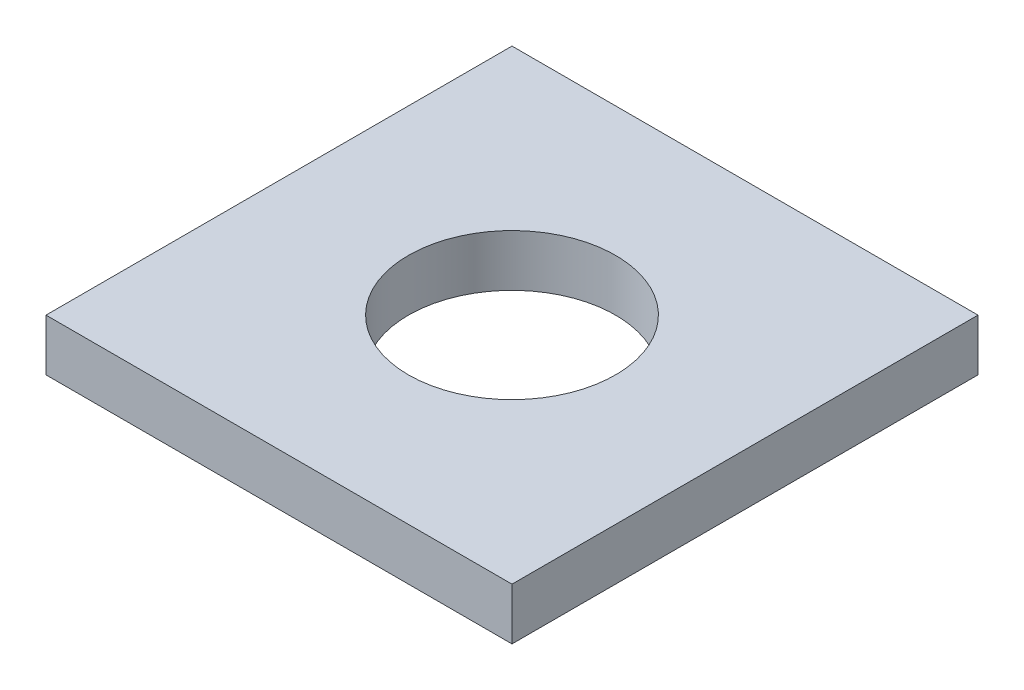
ISO-10303-21;
HEADER;
FILE_DESCRIPTION(('STEP AP214'),'2;1');
FILE_NAME('part.step','',(''),(''),'','','');
FILE_SCHEMA(('AUTOMOTIVE_DESIGN { 1 0 10303 214 1 1 1 1 }'));
ENDSEC;
DATA;
#1=APPLICATION_CONTEXT('core data for automotive mechanical design processes');
#2=APPLICATION_PROTOCOL_DEFINITION('international standard','automotive_design',2000,#1);
#3=PRODUCT_CONTEXT('',#1,'mechanical');
#4=PRODUCT('Part','Part','',(#3));
#5=PRODUCT_RELATED_PRODUCT_CATEGORY('part','',(#4));
#6=PRODUCT_DEFINITION_FORMATION('','',#4);
#7=PRODUCT_DEFINITION_CONTEXT('part definition',#1,'design');
#8=PRODUCT_DEFINITION('design','',#6,#7);
#9=PRODUCT_DEFINITION_SHAPE('','',#8);
#10=(LENGTH_UNIT() NAMED_UNIT(*) SI_UNIT(.MILLI.,.METRE.));
#11=(NAMED_UNIT(*) PLANE_ANGLE_UNIT() SI_UNIT($,.RADIAN.));
#12=(NAMED_UNIT(*) SI_UNIT($,.STERADIAN.) SOLID_ANGLE_UNIT());
#13=UNCERTAINTY_MEASURE_WITH_UNIT(LENGTH_MEASURE(1.E-05),#10,'distance_accuracy_value','');
#14=(GEOMETRIC_REPRESENTATION_CONTEXT(3) GLOBAL_UNCERTAINTY_ASSIGNED_CONTEXT((#13)) GLOBAL_UNIT_ASSIGNED_CONTEXT((#10,
#11,#12)) REPRESENTATION_CONTEXT('',''));
#15=CARTESIAN_POINT('',(0.,0.,0.));
#16=DIRECTION('',(0.,0.,1.));
#17=DIRECTION('',(1.,0.,0.));
#18=AXIS2_PLACEMENT_3D('',#15,#16,#17);
#19=CARTESIAN_POINT('',(0.,5.,0.));
#20=DIRECTION('',(0.,-1.,0.));
#21=DIRECTION('',(0.,0.,-1.));
#22=AXIS2_PLACEMENT_3D('',#19,#20,#21);
#23=PLANE('',#22);
#24=DIRECTION('',(0.,0.,-1.));
#25=VECTOR('',#24,1.);
#26=CARTESIAN_POINT('',(22.5,5.,22.5));
#27=LINE('',#26,#25);
#28=CARTESIAN_POINT('',(22.5,5.,22.5));
#29=VERTEX_POINT('',#28);
#30=CARTESIAN_POINT('',(22.5,5.,-22.5));
#31=VERTEX_POINT('',#30);
#32=EDGE_CURVE('E98',#29,#31,#27,.T.);
#33=ORIENTED_EDGE('',*,*,#32,.T.);
#34=DIRECTION('',(-1.,0.,0.));
#35=VECTOR('',#34,1.);
#36=CARTESIAN_POINT('',(-22.5,5.,-22.5));
#37=LINE('',#36,#35);
#38=CARTESIAN_POINT('',(-22.5,5.,-22.5));
#39=VERTEX_POINT('',#38);
#40=EDGE_CURVE('E93',#31,#39,#37,.T.);
#41=ORIENTED_EDGE('',*,*,#40,.T.);
#42=DIRECTION('',(0.,0.,1.));
#43=VECTOR('',#42,1.);
#44=CARTESIAN_POINT('',(-22.5,5.,22.5));
#45=LINE('',#44,#43);
#46=CARTESIAN_POINT('',(-22.5,5.,22.5));
#47=VERTEX_POINT('',#46);
#48=EDGE_CURVE('E96',#39,#47,#45,.T.);
#49=ORIENTED_EDGE('',*,*,#48,.T.);
#50=DIRECTION('',(1.,0.,0.));
#51=VECTOR('',#50,1.);
#52=CARTESIAN_POINT('',(-22.5,5.,22.5));
#53=LINE('',#52,#51);
#54=EDGE_CURVE('E63',#47,#29,#53,.T.);
#55=ORIENTED_EDGE('',*,*,#54,.T.);
#56=EDGE_LOOP('',(#33,#41,#49,#55));
#57=FACE_BOUND('',#56,.T.);
#58=CARTESIAN_POINT('',(0.,5.,0.));
#59=DIRECTION('',(0.,1.,0.));
#60=DIRECTION('',(0.,0.,1.));
#61=AXIS2_PLACEMENT_3D('',#58,#59,#60);
#62=CIRCLE('',#61,10.);
#63=CARTESIAN_POINT('',(0.,5.,10.));
#64=VERTEX_POINT('',#63);
#65=EDGE_CURVE('E118',#64,#64,#62,.T.);
#66=ORIENTED_EDGE('',*,*,#65,.F.);
#67=EDGE_LOOP('',(#66));
#68=FACE_BOUND('',#67,.T.);
#69=ADVANCED_FACE('F45',(#57,#68),#23,.F.);
#70=CARTESIAN_POINT('',(0.,0.,0.));
#71=DIRECTION('',(0.,-1.,0.));
#72=DIRECTION('',(0.,0.,-1.));
#73=AXIS2_PLACEMENT_3D('',#70,#71,#72);
#74=PLANE('',#73);
#75=DIRECTION('',(0.,0.,-1.));
#76=VECTOR('',#75,1.);
#77=CARTESIAN_POINT('',(22.5,0.,22.5));
#78=LINE('',#77,#76);
#79=CARTESIAN_POINT('',(22.5,0.,22.5));
#80=VERTEX_POINT('',#79);
#81=CARTESIAN_POINT('',(22.5,0.,-22.5));
#82=VERTEX_POINT('',#81);
#83=EDGE_CURVE('E114',#80,#82,#78,.T.);
#84=ORIENTED_EDGE('',*,*,#83,.F.);
#85=DIRECTION('',(1.,0.,0.));
#86=VECTOR('',#85,1.);
#87=CARTESIAN_POINT('',(-22.5,0.,22.5));
#88=LINE('',#87,#86);
#89=CARTESIAN_POINT('',(-22.5,0.,22.5));
#90=VERTEX_POINT('',#89);
#91=EDGE_CURVE('E86',#90,#80,#88,.T.);
#92=ORIENTED_EDGE('',*,*,#91,.F.);
#93=DIRECTION('',(0.,0.,1.));
#94=VECTOR('',#93,1.);
#95=CARTESIAN_POINT('',(-22.5,0.,22.5));
#96=LINE('',#95,#94);
#97=CARTESIAN_POINT('',(-22.5,0.,-22.5));
#98=VERTEX_POINT('',#97);
#99=EDGE_CURVE('E80',#98,#90,#96,.T.);
#100=ORIENTED_EDGE('',*,*,#99,.F.);
#101=DIRECTION('',(-1.,0.,0.));
#102=VECTOR('',#101,1.);
#103=CARTESIAN_POINT('',(-22.5,0.,-22.5));
#104=LINE('',#103,#102);
#105=EDGE_CURVE('E103',#82,#98,#104,.T.);
#106=ORIENTED_EDGE('',*,*,#105,.F.);
#107=EDGE_LOOP('',(#84,#92,#100,#106));
#108=FACE_BOUND('',#107,.T.);
#109=CARTESIAN_POINT('',(0.,0.,0.));
#110=DIRECTION('',(0.,1.,0.));
#111=DIRECTION('',(0.,0.,1.));
#112=AXIS2_PLACEMENT_3D('',#109,#110,#111);
#113=CIRCLE('',#112,10.);
#114=CARTESIAN_POINT('',(0.,0.,10.));
#115=VERTEX_POINT('',#114);
#116=EDGE_CURVE('E136',#115,#115,#113,.T.);
#117=ORIENTED_EDGE('',*,*,#116,.T.);
#118=EDGE_LOOP('',(#117));
#119=FACE_BOUND('',#118,.T.);
#120=ADVANCED_FACE('F131',(#108,#119),#74,.T.);
#121=CARTESIAN_POINT('',(22.5,5.,22.5));
#122=DIRECTION('',(-1.,0.,0.));
#123=DIRECTION('',(0.,0.,1.));
#124=AXIS2_PLACEMENT_3D('',#121,#122,#123);
#125=PLANE('',#124);
#126=ORIENTED_EDGE('',*,*,#83,.T.);
#127=DIRECTION('',(0.,-1.,0.));
#128=VECTOR('',#127,1.);
#129=CARTESIAN_POINT('',(22.5,5.,-22.5));
#130=LINE('',#129,#128);
#131=EDGE_CURVE('E11',#31,#82,#130,.T.);
#132=ORIENTED_EDGE('',*,*,#131,.F.);
#133=ORIENTED_EDGE('',*,*,#32,.F.);
#134=DIRECTION('',(0.,-1.,0.));
#135=VECTOR('',#134,1.);
#136=CARTESIAN_POINT('',(22.5,5.,22.5));
#137=LINE('',#136,#135);
#138=EDGE_CURVE('E110',#29,#80,#137,.T.);
#139=ORIENTED_EDGE('',*,*,#138,.T.);
#140=EDGE_LOOP('',(#126,#132,#133,#139));
#141=FACE_BOUND('',#140,.T.);
#142=ADVANCED_FACE('F47',(#141),#125,.F.);
#143=CARTESIAN_POINT('',(-22.5,5.,-22.5));
#144=DIRECTION('',(0.,0.,1.));
#145=DIRECTION('',(1.,0.,0.));
#146=AXIS2_PLACEMENT_3D('',#143,#144,#145);
#147=PLANE('',#146);
#148=ORIENTED_EDGE('',*,*,#105,.T.);
#149=DIRECTION('',(0.,-1.,0.));
#150=VECTOR('',#149,1.);
#151=CARTESIAN_POINT('',(-22.5,5.,-22.5));
#152=LINE('',#151,#150);
#153=EDGE_CURVE('E55',#39,#98,#152,.T.);
#154=ORIENTED_EDGE('',*,*,#153,.F.);
#155=ORIENTED_EDGE('',*,*,#40,.F.);
#156=ORIENTED_EDGE('',*,*,#131,.T.);
#157=EDGE_LOOP('',(#148,#154,#155,#156));
#158=FACE_BOUND('',#157,.T.);
#159=ADVANCED_FACE('F102',(#158),#147,.F.);
#160=CARTESIAN_POINT('',(-22.5,5.,22.5));
#161=DIRECTION('',(1.,0.,0.));
#162=DIRECTION('',(0.,0.,-1.));
#163=AXIS2_PLACEMENT_3D('',#160,#161,#162);
#164=PLANE('',#163);
#165=ORIENTED_EDGE('',*,*,#99,.T.);
#166=DIRECTION('',(0.,-1.,0.));
#167=VECTOR('',#166,1.);
#168=CARTESIAN_POINT('',(-22.5,5.,22.5));
#169=LINE('',#168,#167);
#170=EDGE_CURVE('E105',#47,#90,#169,.T.);
#171=ORIENTED_EDGE('',*,*,#170,.F.);
#172=ORIENTED_EDGE('',*,*,#48,.F.);
#173=ORIENTED_EDGE('',*,*,#153,.T.);
#174=EDGE_LOOP('',(#165,#171,#172,#173));
#175=FACE_BOUND('',#174,.T.);
#176=ADVANCED_FACE('F106',(#175),#164,.F.);
#177=CARTESIAN_POINT('',(-22.5,5.,22.5));
#178=DIRECTION('',(0.,0.,-1.));
#179=DIRECTION('',(-1.,0.,0.));
#180=AXIS2_PLACEMENT_3D('',#177,#178,#179);
#181=PLANE('',#180);
#182=ORIENTED_EDGE('',*,*,#91,.T.);
#183=ORIENTED_EDGE('',*,*,#138,.F.);
#184=ORIENTED_EDGE('',*,*,#54,.F.);
#185=ORIENTED_EDGE('',*,*,#170,.T.);
#186=EDGE_LOOP('',(#182,#183,#184,#185));
#187=FACE_BOUND('',#186,.T.);
#188=ADVANCED_FACE('F128',(#187),#181,.F.);
#189=CARTESIAN_POINT('',(0.,5.,0.));
#190=DIRECTION('',(0.,-1.,0.));
#191=DIRECTION('',(0.,0.,-1.));
#192=AXIS2_PLACEMENT_3D('',#189,#190,#191);
#193=CYLINDRICAL_SURFACE('',#192,10.);
#194=ORIENTED_EDGE('',*,*,#65,.T.);
#195=EDGE_LOOP('',(#194));
#196=FACE_BOUND('',#195,.T.);
#197=ORIENTED_EDGE('',*,*,#116,.F.);
#198=EDGE_LOOP('',(#197));
#199=FACE_BOUND('',#198,.T.);
#200=ADVANCED_FACE('F144',(#196,#199),#193,.F.);
#201=CLOSED_SHELL('',(#69,#120,#142,#159,#176,#188,#200));
#202=MANIFOLD_SOLID_BREP('B2',#201);
#203=ADVANCED_BREP_SHAPE_REPRESENTATION('',(#18,#202),#14);
#204=SHAPE_DEFINITION_REPRESENTATION(#9,#203);
ENDSEC;
END-ISO-10303-21;
